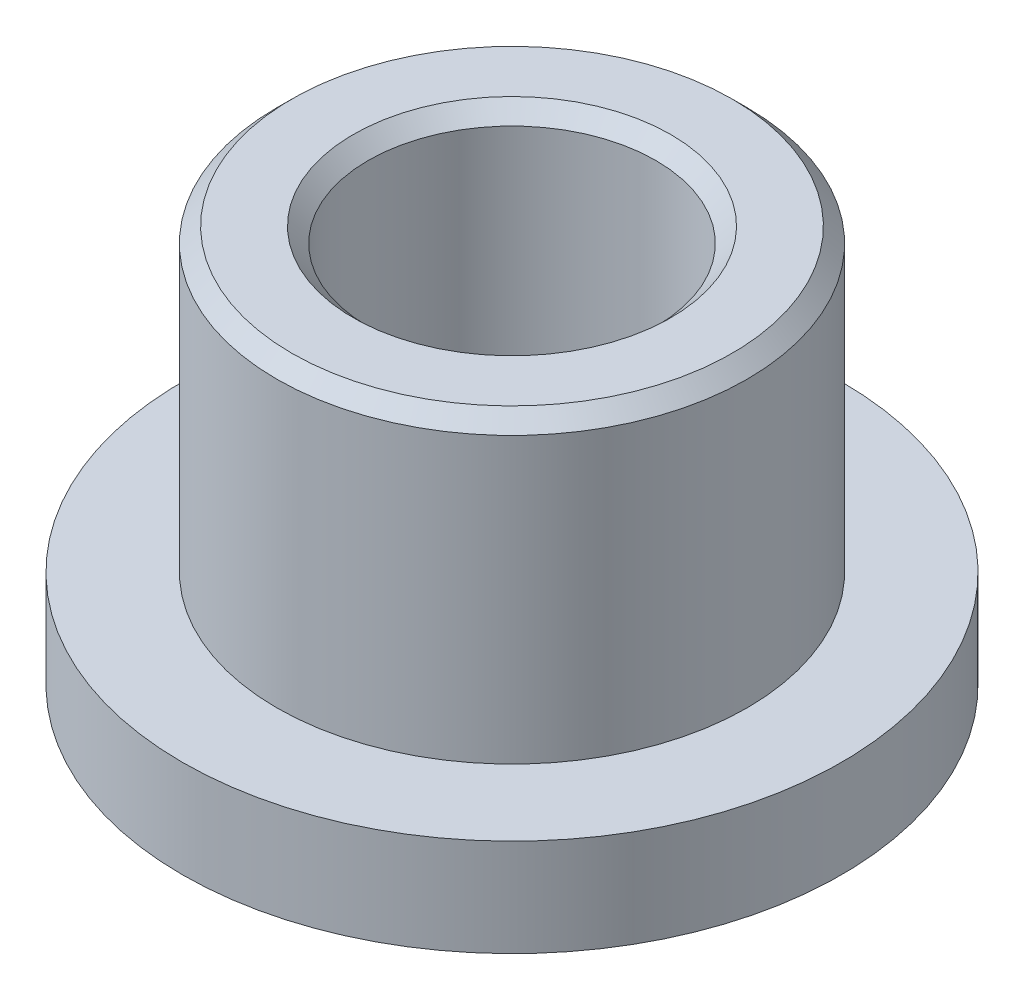
ISO-10303-21;
HEADER;
FILE_DESCRIPTION(('STEP AP214'),'2;1');
FILE_NAME('part.step','',(''),(''),'','','');
FILE_SCHEMA(('AUTOMOTIVE_DESIGN { 1 0 10303 214 1 1 1 1 }'));
ENDSEC;
DATA;
#1=APPLICATION_CONTEXT('core data for automotive mechanical design processes');
#2=APPLICATION_PROTOCOL_DEFINITION('international standard','automotive_design',2000,#1);
#3=PRODUCT_CONTEXT('',#1,'mechanical');
#4=PRODUCT('Part','Part','',(#3));
#5=PRODUCT_RELATED_PRODUCT_CATEGORY('part','',(#4));
#6=PRODUCT_DEFINITION_FORMATION('','',#4);
#7=PRODUCT_DEFINITION_CONTEXT('part definition',#1,'design');
#8=PRODUCT_DEFINITION('design','',#6,#7);
#9=PRODUCT_DEFINITION_SHAPE('','',#8);
#10=(LENGTH_UNIT() NAMED_UNIT(*) SI_UNIT(.MILLI.,.METRE.));
#11=(NAMED_UNIT(*) PLANE_ANGLE_UNIT() SI_UNIT($,.RADIAN.));
#12=(NAMED_UNIT(*) SI_UNIT($,.STERADIAN.) SOLID_ANGLE_UNIT());
#13=UNCERTAINTY_MEASURE_WITH_UNIT(LENGTH_MEASURE(1.E-05),#10,'distance_accuracy_value','');
#14=(GEOMETRIC_REPRESENTATION_CONTEXT(3) GLOBAL_UNCERTAINTY_ASSIGNED_CONTEXT((#13)) GLOBAL_UNIT_ASSIGNED_CONTEXT((#10,
#11,#12)) REPRESENTATION_CONTEXT('',''));
#15=CARTESIAN_POINT('',(0.,0.,0.));
#16=DIRECTION('',(0.,0.,1.));
#17=DIRECTION('',(1.,0.,0.));
#18=AXIS2_PLACEMENT_3D('',#15,#16,#17);
#19=CARTESIAN_POINT('',(5.5,1.62560000005684,0.));
#20=DIRECTION('',(0.,-1.,0.));
#21=DIRECTION('',(0.,0.,-1.));
#22=AXIS2_PLACEMENT_3D('',#19,#20,#21);
#23=PLANE('',#22);
#24=CARTESIAN_POINT('',(0.,1.62560000005684,0.));
#25=DIRECTION('',(0.,1.,0.));
#26=DIRECTION('',(0.,0.,1.));
#27=AXIS2_PLACEMENT_3D('',#24,#25,#26);
#28=CIRCLE('',#27,3.92500000001473);
#29=CARTESIAN_POINT('',(0.,1.62560000005684,3.92500000001473));
#30=VERTEX_POINT('',#29);
#31=EDGE_CURVE('E63',#30,#30,#28,.T.);
#32=ORIENTED_EDGE('',*,*,#31,.F.);
#33=EDGE_LOOP('',(#32));
#34=FACE_BOUND('',#33,.T.);
#35=CARTESIAN_POINT('',(0.,1.62560000005684,0.));
#36=DIRECTION('',(0.,1.,0.));
#37=DIRECTION('',(0.,0.,1.));
#38=AXIS2_PLACEMENT_3D('',#35,#36,#37);
#39=CIRCLE('',#38,5.5);
#40=CARTESIAN_POINT('',(0.,1.62560000005684,5.5));
#41=VERTEX_POINT('',#40);
#42=EDGE_CURVE('E51',#41,#41,#39,.T.);
#43=ORIENTED_EDGE('',*,*,#42,.T.);
#44=EDGE_LOOP('',(#43));
#45=FACE_BOUND('',#44,.T.);
#46=ADVANCED_FACE('F31',(#34,#45),#23,.F.);
#47=CARTESIAN_POINT('',(0.,0.,0.));
#48=DIRECTION('',(0.,1.,0.));
#49=DIRECTION('',(0.,0.,1.));
#50=AXIS2_PLACEMENT_3D('',#47,#48,#49);
#51=CYLINDRICAL_SURFACE('',#50,5.5);
#52=ORIENTED_EDGE('',*,*,#42,.F.);
#53=EDGE_LOOP('',(#52));
#54=FACE_BOUND('',#53,.T.);
#55=CARTESIAN_POINT('',(0.,5.68434763593111E-11,0.));
#56=DIRECTION('',(0.,1.,0.));
#57=DIRECTION('',(0.,0.,1.));
#58=AXIS2_PLACEMENT_3D('',#55,#56,#57);
#59=CIRCLE('',#58,5.5);
#60=CARTESIAN_POINT('',(0.,5.68434763593111E-11,5.5));
#61=VERTEX_POINT('',#60);
#62=EDGE_CURVE('E54',#61,#61,#59,.T.);
#63=ORIENTED_EDGE('',*,*,#62,.T.);
#64=EDGE_LOOP('',(#63));
#65=FACE_BOUND('',#64,.T.);
#66=ADVANCED_FACE('F71',(#54,#65),#51,.T.);
#67=CARTESIAN_POINT('',(5.5,5.68434476100596E-11,0.));
#68=DIRECTION('',(0.,1.,0.));
#69=DIRECTION('',(0.,0.,1.));
#70=AXIS2_PLACEMENT_3D('',#67,#68,#69);
#71=PLANE('',#70);
#72=ORIENTED_EDGE('',*,*,#62,.F.);
#73=EDGE_LOOP('',(#72));
#74=FACE_BOUND('',#73,.T.);
#75=CARTESIAN_POINT('',(0.,5.6843418860808E-11,0.));
#76=DIRECTION('',(0.,1.,0.));
#77=DIRECTION('',(0.,0.,1.));
#78=AXIS2_PLACEMENT_3D('',#75,#76,#77);
#79=CIRCLE('',#78,2.59999999997262);
#80=CARTESIAN_POINT('',(0.,5.6843418860808E-11,2.59999999997262));
#81=VERTEX_POINT('',#80);
#82=EDGE_CURVE('E57',#81,#81,#79,.T.);
#83=ORIENTED_EDGE('',*,*,#82,.T.);
#84=EDGE_LOOP('',(#83));
#85=FACE_BOUND('',#84,.T.);
#86=ADVANCED_FACE('F77',(#74,#85),#71,.F.);
#87=CARTESIAN_POINT('',(0.,0.200000000014732,0.));
#88=DIRECTION('',(0.,-1.,0.));
#89=DIRECTION('',(0.,0.,-1.));
#90=AXIS2_PLACEMENT_3D('',#87,#88,#89);
#91=CONICAL_SURFACE('',#90,2.40000000001473,0.785398163397448);
#92=ORIENTED_EDGE('',*,*,#82,.F.);
#93=EDGE_LOOP('',(#92));
#94=FACE_BOUND('',#93,.T.);
#95=CARTESIAN_POINT('',(0.,0.200000000014732,0.));
#96=DIRECTION('',(0.,1.,0.));
#97=DIRECTION('',(0.,0.,1.));
#98=AXIS2_PLACEMENT_3D('',#95,#96,#97);
#99=CIRCLE('',#98,2.40000000001473);
#100=CARTESIAN_POINT('',(0.,0.200000000014732,2.40000000001473));
#101=VERTEX_POINT('',#100);
#102=EDGE_CURVE('E60',#101,#101,#99,.T.);
#103=ORIENTED_EDGE('',*,*,#102,.T.);
#104=EDGE_LOOP('',(#103));
#105=FACE_BOUND('',#104,.T.);
#106=ADVANCED_FACE('F83',(#94,#105),#91,.F.);
#107=CARTESIAN_POINT('',(0.,0.,0.));
#108=DIRECTION('',(0.,1.,0.));
#109=DIRECTION('',(0.,0.,1.));
#110=AXIS2_PLACEMENT_3D('',#107,#108,#109);
#111=CYLINDRICAL_SURFACE('',#110,2.40000000001473);
#112=CARTESIAN_POINT('',(0.,6.37560000004211,0.));
#113=DIRECTION('',(0.,-1.,0.));
#114=DIRECTION('',(0.,0.,-1.));
#115=AXIS2_PLACEMENT_3D('',#112,#113,#114);
#116=CIRCLE('',#115,2.40000000001473);
#117=CARTESIAN_POINT('',(0.,6.37560000004211,-2.40000000001473));
#118=VERTEX_POINT('',#117);
#119=EDGE_CURVE('E46',#118,#118,#116,.F.);
#120=ORIENTED_EDGE('',*,*,#119,.T.);
#121=EDGE_LOOP('',(#120));
#122=FACE_BOUND('',#121,.T.);
#123=ORIENTED_EDGE('',*,*,#102,.F.);
#124=EDGE_LOOP('',(#123));
#125=FACE_BOUND('',#124,.T.);
#126=ADVANCED_FACE('F89',(#122,#125),#111,.F.);
#127=CARTESIAN_POINT('',(0.,0.,0.));
#128=DIRECTION('',(0.,1.,0.));
#129=DIRECTION('',(0.,0.,1.));
#130=AXIS2_PLACEMENT_3D('',#127,#128,#129);
#131=CYLINDRICAL_SURFACE('',#130,3.92500000001473);
#132=CARTESIAN_POINT('',(0.,6.37560000004211,0.));
#133=DIRECTION('',(0.,-1.,0.));
#134=DIRECTION('',(0.,0.,-1.));
#135=AXIS2_PLACEMENT_3D('',#132,#133,#134);
#136=CIRCLE('',#135,3.92500000001473);
#137=CARTESIAN_POINT('',(0.,6.37560000004211,-3.92500000001473));
#138=VERTEX_POINT('',#137);
#139=EDGE_CURVE('E10',#138,#138,#136,.T.);
#140=ORIENTED_EDGE('',*,*,#139,.T.);
#141=EDGE_LOOP('',(#140));
#142=FACE_BOUND('',#141,.T.);
#143=ORIENTED_EDGE('',*,*,#31,.T.);
#144=EDGE_LOOP('',(#143));
#145=FACE_BOUND('',#144,.T.);
#146=ADVANCED_FACE('F67',(#142,#145),#131,.T.);
#147=CARTESIAN_POINT('',(-7.,6.62560000004211,-5.5));
#148=DIRECTION('',(0.,-1.,0.));
#149=DIRECTION('',(0.,0.,-1.));
#150=AXIS2_PLACEMENT_3D('',#147,#148,#149);
#151=PLANE('',#150);
#152=CARTESIAN_POINT('',(0.,6.62560000004211,0.));
#153=DIRECTION('',(0.,-1.,0.));
#154=DIRECTION('',(0.,0.,-1.));
#155=AXIS2_PLACEMENT_3D('',#152,#153,#154);
#156=CIRCLE('',#155,2.65000000001474);
#157=CARTESIAN_POINT('',(0.,6.62560000004211,-2.65000000001474));
#158=VERTEX_POINT('',#157);
#159=EDGE_CURVE('E38',#158,#158,#156,.T.);
#160=ORIENTED_EDGE('',*,*,#159,.T.);
#161=EDGE_LOOP('',(#160));
#162=FACE_BOUND('',#161,.T.);
#163=CARTESIAN_POINT('',(0.,6.62560000004211,0.));
#164=DIRECTION('',(0.,-1.,0.));
#165=DIRECTION('',(0.,0.,-1.));
#166=AXIS2_PLACEMENT_3D('',#163,#164,#165);
#167=CIRCLE('',#166,3.67500000001473);
#168=CARTESIAN_POINT('',(0.,6.62560000004211,-3.67500000001473));
#169=VERTEX_POINT('',#168);
#170=EDGE_CURVE('E42',#169,#169,#167,.F.);
#171=ORIENTED_EDGE('',*,*,#170,.T.);
#172=EDGE_LOOP('',(#171));
#173=FACE_BOUND('',#172,.T.);
#174=ADVANCED_FACE('F99',(#162,#173),#151,.F.);
#175=CARTESIAN_POINT('',(0.,6.37560000004211,0.));
#176=DIRECTION('',(0.,1.,0.));
#177=DIRECTION('',(0.,0.,1.));
#178=AXIS2_PLACEMENT_3D('',#175,#176,#177);
#179=CONICAL_SURFACE('',#178,2.40000000001473,0.785398163397449);
#180=ORIENTED_EDGE('',*,*,#159,.F.);
#181=EDGE_LOOP('',(#180));
#182=FACE_BOUND('',#181,.T.);
#183=ORIENTED_EDGE('',*,*,#119,.F.);
#184=EDGE_LOOP('',(#183));
#185=FACE_BOUND('',#184,.T.);
#186=ADVANCED_FACE('F102',(#182,#185),#179,.F.);
#187=CARTESIAN_POINT('',(0.,6.37560000004211,0.));
#188=DIRECTION('',(0.,-1.,0.));
#189=DIRECTION('',(0.,0.,-1.));
#190=AXIS2_PLACEMENT_3D('',#187,#188,#189);
#191=CONICAL_SURFACE('',#190,3.92500000001473,0.785398163397452);
#192=ORIENTED_EDGE('',*,*,#170,.F.);
#193=EDGE_LOOP('',(#192));
#194=FACE_BOUND('',#193,.T.);
#195=ORIENTED_EDGE('',*,*,#139,.F.);
#196=EDGE_LOOP('',(#195));
#197=FACE_BOUND('',#196,.T.);
#198=ADVANCED_FACE('F33',(#194,#197),#191,.T.);
#199=CLOSED_SHELL('',(#46,#66,#86,#106,#126,#146,#174,#186,#198));
#200=MANIFOLD_SOLID_BREP('B2',#199);
#201=ADVANCED_BREP_SHAPE_REPRESENTATION('',(#18,#200),#14);
#202=SHAPE_DEFINITION_REPRESENTATION(#9,#201);
ENDSEC;
END-ISO-10303-21;
